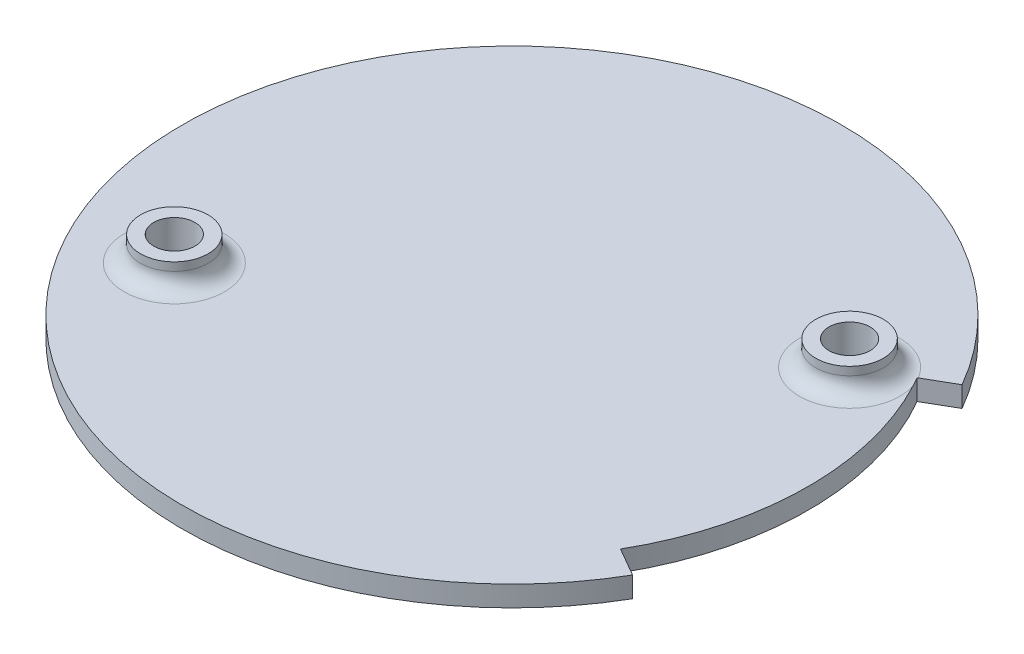
ISO-10303-21;
HEADER;
FILE_DESCRIPTION(('STEP AP214'),'2;1');
FILE_NAME('part.step','',(''),(''),'','','');
FILE_SCHEMA(('AUTOMOTIVE_DESIGN { 1 0 10303 214 1 1 1 1 }'));
ENDSEC;
DATA;
#1=APPLICATION_CONTEXT('core data for automotive mechanical design processes');
#2=APPLICATION_PROTOCOL_DEFINITION('international standard','automotive_design',2000,#1);
#3=PRODUCT_CONTEXT('',#1,'mechanical');
#4=PRODUCT('Part','Part','',(#3));
#5=PRODUCT_RELATED_PRODUCT_CATEGORY('part','',(#4));
#6=PRODUCT_DEFINITION_FORMATION('','',#4);
#7=PRODUCT_DEFINITION_CONTEXT('part definition',#1,'design');
#8=PRODUCT_DEFINITION('design','',#6,#7);
#9=PRODUCT_DEFINITION_SHAPE('','',#8);
#10=(LENGTH_UNIT() NAMED_UNIT(*) SI_UNIT(.MILLI.,.METRE.));
#11=(NAMED_UNIT(*) PLANE_ANGLE_UNIT() SI_UNIT($,.RADIAN.));
#12=(NAMED_UNIT(*) SI_UNIT($,.STERADIAN.) SOLID_ANGLE_UNIT());
#13=UNCERTAINTY_MEASURE_WITH_UNIT(LENGTH_MEASURE(1.E-05),#10,'distance_accuracy_value','');
#14=(GEOMETRIC_REPRESENTATION_CONTEXT(3) GLOBAL_UNCERTAINTY_ASSIGNED_CONTEXT((#13)) GLOBAL_UNIT_ASSIGNED_CONTEXT((#10,
#11,#12)) REPRESENTATION_CONTEXT('',''));
#15=CARTESIAN_POINT('',(0.,0.,0.));
#16=DIRECTION('',(0.,0.,1.));
#17=DIRECTION('',(1.,0.,0.));
#18=AXIS2_PLACEMENT_3D('',#15,#16,#17);
#19=CARTESIAN_POINT('',(0.,15.875,0.));
#20=DIRECTION('',(0.,1.,0.));
#21=DIRECTION('',(0.,0.,1.));
#22=AXIS2_PLACEMENT_3D('',#19,#20,#21);
#23=PLANE('',#22);
#24=CARTESIAN_POINT('',(-32.9955678841872,15.875,19.0499999999999));
#25=DIRECTION('',(0.,-1.,0.));
#26=DIRECTION('',(0.,0.,-1.));
#27=AXIS2_PLACEMENT_3D('',#24,#25,#26);
#28=CIRCLE('',#27,1.65);
#29=CARTESIAN_POINT('',(-32.9955678841872,15.875,17.3999999999999));
#30=VERTEX_POINT('',#29);
#31=EDGE_CURVE('E256',#30,#30,#28,.T.);
#32=ORIENTED_EDGE('',*,*,#31,.F.);
#33=EDGE_LOOP('',(#32));
#34=FACE_BOUND('',#33,.T.);
#35=CARTESIAN_POINT('',(32.9955678841872,15.875,-19.0499999999999));
#36=DIRECTION('',(0.,-1.,0.));
#37=DIRECTION('',(0.,0.,-1.));
#38=AXIS2_PLACEMENT_3D('',#35,#36,#37);
#39=CIRCLE('',#38,1.65);
#40=CARTESIAN_POINT('',(32.9955678841872,15.875,-20.6999999999999));
#41=VERTEX_POINT('',#40);
#42=EDGE_CURVE('E253',#41,#41,#39,.T.);
#43=ORIENTED_EDGE('',*,*,#42,.F.);
#44=EDGE_LOOP('',(#43));
#45=FACE_BOUND('',#44,.T.);
#46=DIRECTION('',(-0.866025403784438,0.,0.500000000000001));
#47=VECTOR('',#46,1.);
#48=CARTESIAN_POINT('',(0.,15.875,0.));
#49=LINE('',#48,#47);
#50=CARTESIAN_POINT('',(43.9940905122494,15.875,-25.4000000000001));
#51=VERTEX_POINT('',#50);
#52=CARTESIAN_POINT('',(39.5946814610245,15.875,-22.86));
#53=VERTEX_POINT('',#52);
#54=EDGE_CURVE('E91',#51,#53,#49,.T.);
#55=ORIENTED_EDGE('',*,*,#54,.T.);
#56=CARTESIAN_POINT('',(0.,15.875,0.));
#57=DIRECTION('',(0.,1.,0.));
#58=DIRECTION('',(0.,0.,1.));
#59=AXIS2_PLACEMENT_3D('',#56,#57,#58);
#60=CIRCLE('',#59,45.72);
#61=CARTESIAN_POINT('',(39.5946814610245,15.875,22.86));
#62=VERTEX_POINT('',#61);
#63=EDGE_CURVE('E92',#53,#62,#60,.F.);
#64=ORIENTED_EDGE('',*,*,#63,.T.);
#65=DIRECTION('',(-0.866025403784438,0.,-0.500000000000001));
#66=VECTOR('',#65,1.);
#67=CARTESIAN_POINT('',(0.,15.875,0.));
#68=LINE('',#67,#66);
#69=CARTESIAN_POINT('',(43.9940905122494,15.875,25.4000000000001));
#70=VERTEX_POINT('',#69);
#71=EDGE_CURVE('E105',#70,#62,#68,.T.);
#72=ORIENTED_EDGE('',*,*,#71,.F.);
#73=CARTESIAN_POINT('',(0.,15.875,0.));
#74=DIRECTION('',(0.,1.,0.));
#75=DIRECTION('',(0.,0.,1.));
#76=AXIS2_PLACEMENT_3D('',#73,#74,#75);
#77=CIRCLE('',#76,50.8);
#78=EDGE_CURVE('E95',#51,#70,#77,.T.);
#79=ORIENTED_EDGE('',*,*,#78,.F.);
#80=EDGE_LOOP('',(#55,#64,#72,#79));
#81=FACE_BOUND('',#80,.T.);
#82=ADVANCED_FACE('F40',(#34,#45,#81),#23,.F.);
#83=CARTESIAN_POINT('',(0.,3.175,0.));
#84=DIRECTION('',(0.,-1.,0.));
#85=DIRECTION('',(0.,0.,-1.));
#86=AXIS2_PLACEMENT_3D('',#83,#84,#85);
#87=CYLINDRICAL_SURFACE('',#86,50.8);
#88=DIRECTION('',(0.,1.,0.));
#89=VECTOR('',#88,1.);
#90=CARTESIAN_POINT('',(43.9940905122494,0.,-25.4000000000001));
#91=LINE('',#90,#89);
#92=CARTESIAN_POINT('',(43.9940905122494,19.05,-25.4000000000001));
#93=VERTEX_POINT('',#92);
#94=EDGE_CURVE('E109',#51,#93,#91,.T.);
#95=ORIENTED_EDGE('',*,*,#94,.F.);
#96=ORIENTED_EDGE('',*,*,#78,.T.);
#97=DIRECTION('',(0.,1.,0.));
#98=VECTOR('',#97,1.);
#99=CARTESIAN_POINT('',(43.9940905122494,0.,25.4000000000001));
#100=LINE('',#99,#98);
#101=CARTESIAN_POINT('',(43.9940905122494,19.05,25.4000000000001));
#102=VERTEX_POINT('',#101);
#103=EDGE_CURVE('E113',#70,#102,#100,.T.);
#104=ORIENTED_EDGE('',*,*,#103,.T.);
#105=CARTESIAN_POINT('',(0.,19.05,0.));
#106=DIRECTION('',(0.,1.,0.));
#107=DIRECTION('',(0.,0.,1.));
#108=AXIS2_PLACEMENT_3D('',#105,#106,#107);
#109=CIRCLE('',#108,50.8);
#110=EDGE_CURVE('E177',#93,#102,#109,.T.);
#111=ORIENTED_EDGE('',*,*,#110,.F.);
#112=EDGE_LOOP('',(#95,#96,#104,#111));
#113=FACE_BOUND('',#112,.T.);
#114=ADVANCED_FACE('F147',(#113),#87,.T.);
#115=CARTESIAN_POINT('',(0.,0.,0.));
#116=DIRECTION('',(-0.500000000000001,0.,0.866025403784438));
#117=DIRECTION('',(0.866025403784438,0.,0.500000000000001));
#118=AXIS2_PLACEMENT_3D('',#115,#116,#117);
#119=PLANE('',#118);
#120=ORIENTED_EDGE('',*,*,#103,.F.);
#121=ORIENTED_EDGE('',*,*,#71,.T.);
#122=DIRECTION('',(0.,1.,0.));
#123=VECTOR('',#122,1.);
#124=CARTESIAN_POINT('',(39.5946814610245,0.,22.86));
#125=LINE('',#124,#123);
#126=CARTESIAN_POINT('',(39.5946814610245,19.05,22.86));
#127=VERTEX_POINT('',#126);
#128=EDGE_CURVE('E104',#62,#127,#125,.T.);
#129=ORIENTED_EDGE('',*,*,#128,.T.);
#130=DIRECTION('',(-0.866025403784438,0.,-0.500000000000001));
#131=VECTOR('',#130,1.);
#132=CARTESIAN_POINT('',(0.,19.05,0.));
#133=LINE('',#132,#131);
#134=EDGE_CURVE('E174',#102,#127,#133,.T.);
#135=ORIENTED_EDGE('',*,*,#134,.F.);
#136=EDGE_LOOP('',(#120,#121,#129,#135));
#137=FACE_BOUND('',#136,.T.);
#138=ADVANCED_FACE('F153',(#137),#119,.F.);
#139=CARTESIAN_POINT('',(0.,0.,0.));
#140=DIRECTION('',(0.,1.,0.));
#141=DIRECTION('',(0.,0.,1.));
#142=AXIS2_PLACEMENT_3D('',#139,#140,#141);
#143=CYLINDRICAL_SURFACE('',#142,45.72);
#144=ORIENTED_EDGE('',*,*,#63,.F.);
#145=DIRECTION('',(0.,1.,0.));
#146=VECTOR('',#145,1.);
#147=CARTESIAN_POINT('',(39.5946814610245,0.,-22.8600000000001));
#148=LINE('',#147,#146);
#149=CARTESIAN_POINT('',(39.5946814610245,19.0531769868593,-22.8600000000001));
#150=VERTEX_POINT('',#149);
#151=EDGE_CURVE('E59',#53,#150,#148,.T.);
#152=ORIENTED_EDGE('',*,*,#151,.T.);
#153=CARTESIAN_POINT('',(39.5946814610245,19.0531769868593,-22.8600000000001));
#154=CARTESIAN_POINT('',(39.6584509865653,19.0531940198967,-22.7495479663954));
#155=CARTESIAN_POINT('',(39.7217581950967,19.0530434085188,-22.6388293044365));
#156=CARTESIAN_POINT('',(39.8474392470708,19.0525347988836,-22.4168742014402));
#157=CARTESIAN_POINT('',(39.9098131557882,19.0521768152002,-22.3056377973336));
#158=CARTESIAN_POINT('',(40.0336277838406,19.0513813297176,-22.0826472645168));
#159=CARTESIAN_POINT('',(40.0950685040283,19.0509438279912,-21.9708931362797));
#160=CARTESIAN_POINT('',(40.2170171736378,19.0502604060662,-21.746866345461));
#161=CARTESIAN_POINT('',(40.277525056747,19.0500144994265,-21.6345936467463));
#162=CARTESIAN_POINT('',(40.3375623533858,19.05,-21.5220692171247));
#163=B_SPLINE_CURVE_WITH_KNOTS('',3,(#153,#154,#155,#156,#157,#158,#159,#160,#161,#162),
.UNSPECIFIED.,.F.,.F.,(4,2,2,2,4),(0.,0.382615476870098,0.765204067465549,1.14779230850627,
1.53040762235897),.UNSPECIFIED.);
#164=CARTESIAN_POINT('',(40.3375623533858,19.05,-21.5220692171247));
#165=VERTEX_POINT('',#164);
#166=EDGE_CURVE('E11',#150,#165,#163,.T.);
#167=ORIENTED_EDGE('',*,*,#166,.T.);
#168=CARTESIAN_POINT('',(0.,19.05,0.));
#169=DIRECTION('',(0.,1.,0.));
#170=DIRECTION('',(0.,0.,1.));
#171=AXIS2_PLACEMENT_3D('',#168,#169,#170);
#172=CIRCLE('',#171,45.72);
#173=EDGE_CURVE('E183',#127,#165,#172,.T.);
#174=ORIENTED_EDGE('',*,*,#173,.F.);
#175=ORIENTED_EDGE('',*,*,#128,.F.);
#176=EDGE_LOOP('',(#144,#152,#167,#174,#175));
#177=FACE_BOUND('',#176,.T.);
#178=ADVANCED_FACE('F102',(#177),#143,.T.);
#179=CARTESIAN_POINT('',(0.,0.,0.));
#180=DIRECTION('',(0.500000000000001,0.,0.866025403784438));
#181=DIRECTION('',(0.866025403784438,0.,-0.500000000000001));
#182=AXIS2_PLACEMENT_3D('',#179,#180,#181);
#183=PLANE('',#182);
#184=ORIENTED_EDGE('',*,*,#54,.F.);
#185=ORIENTED_EDGE('',*,*,#94,.T.);
#186=DIRECTION('',(0.866025403784438,0.,-0.500000000000001));
#187=VECTOR('',#186,1.);
#188=CARTESIAN_POINT('',(0.,19.05,0.));
#189=LINE('',#188,#187);
#190=CARTESIAN_POINT('',(39.7046666873051,19.05,-22.9235000000001));
#191=VERTEX_POINT('',#190);
#192=EDGE_CURVE('E118',#191,#93,#189,.T.);
#193=ORIENTED_EDGE('',*,*,#192,.F.);
#194=CARTESIAN_POINT('',(39.7046666873052,21.59,-22.9234999999999));
#195=DIRECTION('',(0.500000000000001,0.,0.866025403784438));
#196=DIRECTION('',(0.866025403784438,0.,-0.500000000000001));
#197=AXIS2_PLACEMENT_3D('',#194,#195,#196);
#198=CIRCLE('',#197,2.54);
#199=EDGE_CURVE('E53',#191,#150,#198,.F.);
#200=ORIENTED_EDGE('',*,*,#199,.T.);
#201=ORIENTED_EDGE('',*,*,#151,.F.);
#202=EDGE_LOOP('',(#184,#185,#193,#200,#201));
#203=FACE_BOUND('',#202,.T.);
#204=ADVANCED_FACE('F107',(#203),#183,.T.);
#205=CARTESIAN_POINT('',(0.,19.05,0.));
#206=DIRECTION('',(0.,1.,0.));
#207=DIRECTION('',(0.,0.,1.));
#208=AXIS2_PLACEMENT_3D('',#205,#206,#207);
#209=PLANE('',#208);
#210=CARTESIAN_POINT('',(-32.9955678841872,19.05,19.0499999999999));
#211=DIRECTION('',(0.,1.,0.));
#212=DIRECTION('',(0.,0.,1.));
#213=AXIS2_PLACEMENT_3D('',#210,#211,#212);
#214=CIRCLE('',#213,7.747);
#215=CARTESIAN_POINT('',(-32.9955678841872,19.05,26.7969999999999));
#216=VERTEX_POINT('',#215);
#217=EDGE_CURVE('E121',#216,#216,#214,.F.);
#218=ORIENTED_EDGE('',*,*,#217,.T.);
#219=EDGE_LOOP('',(#218));
#220=FACE_BOUND('',#219,.T.);
#221=ORIENTED_EDGE('',*,*,#173,.T.);
#222=CARTESIAN_POINT('',(32.9955678841872,19.05,-19.0499999999999));
#223=DIRECTION('',(0.,1.,0.));
#224=DIRECTION('',(0.,0.,1.));
#225=AXIS2_PLACEMENT_3D('',#222,#223,#224);
#226=CIRCLE('',#225,7.747);
#227=EDGE_CURVE('E124',#165,#191,#226,.F.);
#228=ORIENTED_EDGE('',*,*,#227,.T.);
#229=ORIENTED_EDGE('',*,*,#192,.T.);
#230=ORIENTED_EDGE('',*,*,#110,.T.);
#231=ORIENTED_EDGE('',*,*,#134,.T.);
#232=EDGE_LOOP('',(#221,#228,#229,#230,#231));
#233=FACE_BOUND('',#232,.T.);
#234=ADVANCED_FACE('F159',(#220,#233),#209,.T.);
#235=CARTESIAN_POINT('',(32.9955678841872,17.78,-19.0499999999999));
#236=DIRECTION('',(0.,1.,0.));
#237=DIRECTION('',(0.,0.,1.));
#238=AXIS2_PLACEMENT_3D('',#235,#236,#237);
#239=PLANE('',#238);
#240=CARTESIAN_POINT('',(32.9955678841872,17.78,-19.0499999999999));
#241=DIRECTION('',(0.,1.,0.));
#242=DIRECTION('',(0.,0.,1.));
#243=AXIS2_PLACEMENT_3D('',#240,#241,#242);
#244=CIRCLE('',#243,1.65);
#245=CARTESIAN_POINT('',(32.9955678841872,17.78,-17.3999999999999));
#246=VERTEX_POINT('',#245);
#247=EDGE_CURVE('E251',#246,#246,#244,.F.);
#248=ORIENTED_EDGE('',*,*,#247,.T.);
#249=EDGE_LOOP('',(#248));
#250=FACE_BOUND('',#249,.T.);
#251=CARTESIAN_POINT('',(32.9955678841872,17.78,-19.0499999999999));
#252=DIRECTION('',(0.,1.,0.));
#253=DIRECTION('',(0.,0.,1.));
#254=AXIS2_PLACEMENT_3D('',#251,#252,#253);
#255=CIRCLE('',#254,3.175);
#256=CARTESIAN_POINT('',(32.9955678841872,17.78,-15.8749999999999));
#257=VERTEX_POINT('',#256);
#258=EDGE_CURVE('E211',#257,#257,#255,.T.);
#259=ORIENTED_EDGE('',*,*,#258,.T.);
#260=EDGE_LOOP('',(#259));
#261=FACE_BOUND('',#260,.T.);
#262=ADVANCED_FACE('F217',(#250,#261),#239,.T.);
#263=CARTESIAN_POINT('',(32.9955678841872,17.78,-19.0499999999999));
#264=DIRECTION('',(0.,1.,0.));
#265=DIRECTION('',(0.,0.,1.));
#266=AXIS2_PLACEMENT_3D('',#263,#264,#265);
#267=CYLINDRICAL_SURFACE('',#266,3.175);
#268=ORIENTED_EDGE('',*,*,#258,.F.);
#269=EDGE_LOOP('',(#268));
#270=FACE_BOUND('',#269,.T.);
#271=CARTESIAN_POINT('',(32.9955678841872,22.86,-19.0499999999999));
#272=DIRECTION('',(0.,1.,0.));
#273=DIRECTION('',(0.,0.,1.));
#274=AXIS2_PLACEMENT_3D('',#271,#272,#273);
#275=CIRCLE('',#274,3.175);
#276=CARTESIAN_POINT('',(32.9955678841872,22.86,-15.8749999999999));
#277=VERTEX_POINT('',#276);
#278=EDGE_CURVE('E199',#277,#277,#275,.F.);
#279=ORIENTED_EDGE('',*,*,#278,.F.);
#280=EDGE_LOOP('',(#279));
#281=FACE_BOUND('',#280,.T.);
#282=ADVANCED_FACE('F219',(#270,#281),#267,.F.);
#283=CARTESIAN_POINT('',(-32.9955678841872,17.78,19.0499999999999));
#284=DIRECTION('',(0.,1.,0.));
#285=DIRECTION('',(0.,0.,1.));
#286=AXIS2_PLACEMENT_3D('',#283,#284,#285);
#287=PLANE('',#286);
#288=CARTESIAN_POINT('',(-32.9955678841872,17.78,19.0499999999999));
#289=DIRECTION('',(0.,1.,0.));
#290=DIRECTION('',(0.,0.,1.));
#291=AXIS2_PLACEMENT_3D('',#288,#289,#290);
#292=CIRCLE('',#291,1.65);
#293=CARTESIAN_POINT('',(-32.9955678841872,17.78,20.6999999999999));
#294=VERTEX_POINT('',#293);
#295=EDGE_CURVE('E205',#294,#294,#292,.F.);
#296=ORIENTED_EDGE('',*,*,#295,.T.);
#297=EDGE_LOOP('',(#296));
#298=FACE_BOUND('',#297,.T.);
#299=CARTESIAN_POINT('',(-32.9955678841872,17.78,19.0499999999999));
#300=DIRECTION('',(0.,1.,0.));
#301=DIRECTION('',(0.,0.,1.));
#302=AXIS2_PLACEMENT_3D('',#299,#300,#301);
#303=CIRCLE('',#302,3.175);
#304=CARTESIAN_POINT('',(-32.9955678841872,17.78,22.2249999999999));
#305=VERTEX_POINT('',#304);
#306=EDGE_CURVE('E99',#305,#305,#303,.T.);
#307=ORIENTED_EDGE('',*,*,#306,.T.);
#308=EDGE_LOOP('',(#307));
#309=FACE_BOUND('',#308,.T.);
#310=ADVANCED_FACE('F222',(#298,#309),#287,.T.);
#311=CARTESIAN_POINT('',(-32.9955678841872,17.78,19.0499999999999));
#312=DIRECTION('',(0.,1.,0.));
#313=DIRECTION('',(0.,0.,1.));
#314=AXIS2_PLACEMENT_3D('',#311,#312,#313);
#315=CYLINDRICAL_SURFACE('',#314,3.175);
#316=ORIENTED_EDGE('',*,*,#306,.F.);
#317=EDGE_LOOP('',(#316));
#318=FACE_BOUND('',#317,.T.);
#319=CARTESIAN_POINT('',(-32.9955678841872,22.86,19.0499999999999));
#320=DIRECTION('',(0.,1.,0.));
#321=DIRECTION('',(0.,0.,1.));
#322=AXIS2_PLACEMENT_3D('',#319,#320,#321);
#323=CIRCLE('',#322,3.175);
#324=CARTESIAN_POINT('',(-32.9955678841872,22.86,22.2249999999999));
#325=VERTEX_POINT('',#324);
#326=EDGE_CURVE('E198',#325,#325,#323,.F.);
#327=ORIENTED_EDGE('',*,*,#326,.F.);
#328=EDGE_LOOP('',(#327));
#329=FACE_BOUND('',#328,.T.);
#330=ADVANCED_FACE('F237',(#318,#329),#315,.F.);
#331=CARTESIAN_POINT('',(-32.9955678841872,22.86,19.0499999999999));
#332=DIRECTION('',(0.,-1.,0.));
#333=DIRECTION('',(0.,0.,-1.));
#334=AXIS2_PLACEMENT_3D('',#331,#332,#333);
#335=CYLINDRICAL_SURFACE('',#334,5.207);
#336=CARTESIAN_POINT('',(-32.9955678841872,21.59,19.0499999999999));
#337=DIRECTION('',(0.,1.,0.));
#338=DIRECTION('',(0.,0.,1.));
#339=AXIS2_PLACEMENT_3D('',#336,#337,#338);
#340=CIRCLE('',#339,5.207);
#341=CARTESIAN_POINT('',(-32.9955678841872,21.59,13.8429999999999));
#342=VERTEX_POINT('',#341);
#343=EDGE_CURVE('E126',#342,#342,#340,.T.);
#344=CARTESIAN_POINT('',(-32.9955678841872,22.86,19.0499999999999));
#345=DIRECTION('',(0.,1.,0.));
#346=DIRECTION('',(0.,0.,1.));
#347=AXIS2_PLACEMENT_3D('',#344,#345,#346);
#348=CIRCLE('',#347,5.207);
#349=CARTESIAN_POINT('',(-32.9955678841872,22.86,13.8429999999999));
#350=VERTEX_POINT('',#349);
#351=EDGE_CURVE('E202',#350,#350,#348,.T.);
#352=CARTESIAN_POINT('',(-32.9955678841872,21.59,13.8429999999999));
#353=CARTESIAN_POINT('',(-32.9955678841872,21.6032291666667,13.8429999999999));
#354=CARTESIAN_POINT('',(-32.9955678841872,21.6164583333333,13.8429999999999));
#355=CARTESIAN_POINT('',(-32.9955678841872,21.6429166666667,13.8429999999999));
#356=CARTESIAN_POINT('',(-32.9955678841872,21.6561458333333,13.8429999999999));
#357=CARTESIAN_POINT('',(-32.9955678841872,21.6826041666667,13.8429999999999));
#358=CARTESIAN_POINT('',(-32.9955678841872,21.6958333333333,13.8429999999999));
#359=CARTESIAN_POINT('',(-32.9955678841872,21.7222916666667,13.8429999999999));
#360=CARTESIAN_POINT('',(-32.9955678841872,21.7355208333333,13.8429999999999));
#361=CARTESIAN_POINT('',(-32.9955678841872,21.7619791666667,13.8429999999999));
#362=CARTESIAN_POINT('',(-32.9955678841872,21.7752083333333,13.8429999999999));
#363=CARTESIAN_POINT('',(-32.9955678841872,21.8016666666667,13.8429999999999));
#364=CARTESIAN_POINT('',(-32.9955678841872,21.8148958333333,13.8429999999999));
#365=CARTESIAN_POINT('',(-32.9955678841872,21.8413541666667,13.8429999999999));
#366=CARTESIAN_POINT('',(-32.9955678841872,21.8545833333333,13.8429999999999));
#367=CARTESIAN_POINT('',(-32.9955678841872,21.8810416666667,13.8429999999999));
#368=CARTESIAN_POINT('',(-32.9955678841872,21.8942708333333,13.8429999999999));
#369=CARTESIAN_POINT('',(-32.9955678841872,21.9207291666667,13.8429999999999));
#370=CARTESIAN_POINT('',(-32.9955678841872,21.9339583333333,13.8429999999999));
#371=CARTESIAN_POINT('',(-32.9955678841872,21.9604166666667,13.8429999999999));
#372=CARTESIAN_POINT('',(-32.9955678841872,21.9736458333333,13.8429999999999));
#373=CARTESIAN_POINT('',(-32.9955678841872,22.0001041666667,13.8429999999999));
#374=CARTESIAN_POINT('',(-32.9955678841872,22.0133333333333,13.8429999999999));
#375=CARTESIAN_POINT('',(-32.9955678841872,22.0397916666667,13.8429999999999));
#376=CARTESIAN_POINT('',(-32.9955678841872,22.0530208333333,13.8429999999999));
#377=CARTESIAN_POINT('',(-32.9955678841872,22.0794791666667,13.8429999999999));
#378=CARTESIAN_POINT('',(-32.9955678841872,22.0927083333333,13.8429999999999));
#379=CARTESIAN_POINT('',(-32.9955678841872,22.1191666666667,13.8429999999999));
#380=CARTESIAN_POINT('',(-32.9955678841872,22.1323958333333,13.8429999999999));
#381=CARTESIAN_POINT('',(-32.9955678841872,22.1588541666667,13.8429999999999));
#382=CARTESIAN_POINT('',(-32.9955678841872,22.1720833333333,13.8429999999999));
#383=CARTESIAN_POINT('',(-32.9955678841872,22.1985416666667,13.8429999999999));
#384=CARTESIAN_POINT('',(-32.9955678841872,22.2117708333333,13.8429999999999));
#385=CARTESIAN_POINT('',(-32.9955678841872,22.2382291666667,13.8429999999999));
#386=CARTESIAN_POINT('',(-32.9955678841872,22.2514583333333,13.8429999999999));
#387=CARTESIAN_POINT('',(-32.9955678841872,22.2779166666667,13.8429999999999));
#388=CARTESIAN_POINT('',(-32.9955678841872,22.2911458333333,13.8429999999999));
#389=CARTESIAN_POINT('',(-32.9955678841872,22.3176041666667,13.8429999999999));
#390=CARTESIAN_POINT('',(-32.9955678841872,22.3308333333333,13.8429999999999));
#391=CARTESIAN_POINT('',(-32.9955678841872,22.3572916666667,13.8429999999999));
#392=CARTESIAN_POINT('',(-32.9955678841872,22.3705208333333,13.8429999999999));
#393=CARTESIAN_POINT('',(-32.9955678841872,22.3969791666667,13.8429999999999));
#394=CARTESIAN_POINT('',(-32.9955678841872,22.4102083333333,13.8429999999999));
#395=CARTESIAN_POINT('',(-32.9955678841872,22.4366666666667,13.8429999999999));
#396=CARTESIAN_POINT('',(-32.9955678841872,22.4498958333333,13.8429999999999));
#397=CARTESIAN_POINT('',(-32.9955678841872,22.4763541666667,13.8429999999999));
#398=CARTESIAN_POINT('',(-32.9955678841872,22.4895833333333,13.8429999999999));
#399=CARTESIAN_POINT('',(-32.9955678841872,22.5160416666667,13.8429999999999));
#400=CARTESIAN_POINT('',(-32.9955678841872,22.5292708333333,13.8429999999999));
#401=CARTESIAN_POINT('',(-32.9955678841872,22.5557291666667,13.8429999999999));
#402=CARTESIAN_POINT('',(-32.9955678841872,22.5689583333333,13.8429999999999));
#403=CARTESIAN_POINT('',(-32.9955678841872,22.5954166666667,13.8429999999999));
#404=CARTESIAN_POINT('',(-32.9955678841872,22.6086458333333,13.8429999999999));
#405=CARTESIAN_POINT('',(-32.9955678841872,22.6351041666667,13.8429999999999));
#406=CARTESIAN_POINT('',(-32.9955678841872,22.6483333333333,13.8429999999999));
#407=CARTESIAN_POINT('',(-32.9955678841872,22.6747916666667,13.8429999999999));
#408=CARTESIAN_POINT('',(-32.9955678841872,22.6880208333333,13.8429999999999));
#409=CARTESIAN_POINT('',(-32.9955678841872,22.7144791666667,13.8429999999999));
#410=CARTESIAN_POINT('',(-32.9955678841872,22.7277083333333,13.8429999999999));
#411=CARTESIAN_POINT('',(-32.9955678841872,22.7541666666667,13.8429999999999));
#412=CARTESIAN_POINT('',(-32.9955678841872,22.7673958333333,13.8429999999999));
#413=CARTESIAN_POINT('',(-32.9955678841872,22.7938541666667,13.8429999999999));
#414=CARTESIAN_POINT('',(-32.9955678841872,22.8070833333333,13.8429999999999));
#415=CARTESIAN_POINT('',(-32.9955678841872,22.8335416666667,13.8429999999999));
#416=CARTESIAN_POINT('',(-32.9955678841872,22.8467708333333,13.8429999999999));
#417=CARTESIAN_POINT('',(-32.9955678841872,22.86,13.8429999999999));
#418=B_SPLINE_CURVE_WITH_KNOTS('',3,(#352,#353,#354,#355,#356,#357,#358,#359,#360,#361,#362,
#363,#364,#365,#366,#367,#368,#369,#370,#371,#372,#373,#374,#375,#376,#377,#378,#379,#380,#381,
#382,#383,#384,#385,#386,#387,#388,#389,#390,#391,#392,#393,#394,#395,#396,#397,#398,#399,#400,
#401,#402,#403,#404,#405,#406,#407,#408,#409,#410,#411,#412,#413,#414,#415,#416,#417),
.UNSPECIFIED.,.F.,.F.,(4,2,2,2,2,2,2,2,2,2,2,2,2,2,2,2,2,2,2,2,2,2,2,2,2,2,2,2,2,2,2,2,4),(0.,
0.0396874999999998,0.0793749999999996,0.119062499999999,0.158749999999999,0.198437499999999,
0.238124999999999,0.277812499999999,0.317499999999998,0.357187499999998,0.396874999999998,
0.436562499999998,0.476249999999998,0.515937499999997,0.555624999999997,0.595312499999997,0.635,
0.6746875,0.714375,0.7540625,0.793749999999999,0.833437499999999,0.873124999999999,
0.912812499999999,0.952499999999998,0.992187499999998,1.031875,1.0715625,1.11125,1.1509375,
1.190625,1.2303125,1.27),.UNSPECIFIED.);
#419=EDGE_CURVE('BSEAM130',#342,#350,#418,.T.);
#420=ORIENTED_EDGE('',*,*,#343,.T.);
#421=ORIENTED_EDGE('',*,*,#351,.F.);
#422=ORIENTED_EDGE('',*,*,#419,.T.);
#423=ORIENTED_EDGE('',*,*,#419,.F.);
#424=EDGE_LOOP('',(#420,#422,#421,#423));
#425=FACE_BOUND('',#424,.T.);
#426=ADVANCED_FACE('F130',(#425),#335,.T.);
#427=CARTESIAN_POINT('',(0.,22.86,0.));
#428=DIRECTION('',(0.,1.,0.));
#429=DIRECTION('',(0.,0.,1.));
#430=AXIS2_PLACEMENT_3D('',#427,#428,#429);
#431=PLANE('',#430);
#432=ORIENTED_EDGE('',*,*,#326,.T.);
#433=EDGE_LOOP('',(#432));
#434=FACE_BOUND('',#433,.T.);
#435=ORIENTED_EDGE('',*,*,#351,.T.);
#436=EDGE_LOOP('',(#435));
#437=FACE_BOUND('',#436,.T.);
#438=ADVANCED_FACE('F192',(#434,#437),#431,.T.);
#439=CARTESIAN_POINT('',(32.9955678841872,22.86,-19.0499999999999));
#440=DIRECTION('',(0.,-1.,0.));
#441=DIRECTION('',(0.,0.,-1.));
#442=AXIS2_PLACEMENT_3D('',#439,#440,#441);
#443=CYLINDRICAL_SURFACE('',#442,5.207);
#444=CARTESIAN_POINT('',(32.9955678841872,21.59,-19.0499999999999));
#445=DIRECTION('',(0.,1.,0.));
#446=DIRECTION('',(0.,0.,1.));
#447=AXIS2_PLACEMENT_3D('',#444,#445,#446);
#448=CIRCLE('',#447,5.207);
#449=CARTESIAN_POINT('',(32.9955678841872,21.59,-24.2569999999999));
#450=VERTEX_POINT('',#449);
#451=EDGE_CURVE('E111',#450,#450,#448,.T.);
#452=CARTESIAN_POINT('',(32.9955678841872,22.86,-19.0499999999999));
#453=DIRECTION('',(0.,1.,0.));
#454=DIRECTION('',(0.,0.,1.));
#455=AXIS2_PLACEMENT_3D('',#452,#453,#454);
#456=CIRCLE('',#455,5.207);
#457=CARTESIAN_POINT('',(32.9955678841872,22.86,-24.2569999999999));
#458=VERTEX_POINT('',#457);
#459=EDGE_CURVE('E196',#458,#458,#456,.T.);
#460=CARTESIAN_POINT('',(32.9955678841872,21.59,-24.2569999999999));
#461=CARTESIAN_POINT('',(32.9955678841872,21.6032291666667,-24.2569999999999));
#462=CARTESIAN_POINT('',(32.9955678841872,21.6164583333333,-24.2569999999999));
#463=CARTESIAN_POINT('',(32.9955678841872,21.6429166666667,-24.2569999999999));
#464=CARTESIAN_POINT('',(32.9955678841872,21.6561458333333,-24.2569999999999));
#465=CARTESIAN_POINT('',(32.9955678841872,21.6826041666667,-24.2569999999999));
#466=CARTESIAN_POINT('',(32.9955678841872,21.6958333333333,-24.2569999999999));
#467=CARTESIAN_POINT('',(32.9955678841872,21.7222916666667,-24.2569999999999));
#468=CARTESIAN_POINT('',(32.9955678841872,21.7355208333333,-24.2569999999999));
#469=CARTESIAN_POINT('',(32.9955678841872,21.7619791666667,-24.2569999999999));
#470=CARTESIAN_POINT('',(32.9955678841872,21.7752083333333,-24.2569999999999));
#471=CARTESIAN_POINT('',(32.9955678841872,21.8016666666667,-24.2569999999999));
#472=CARTESIAN_POINT('',(32.9955678841872,21.8148958333333,-24.2569999999999));
#473=CARTESIAN_POINT('',(32.9955678841872,21.8413541666667,-24.2569999999999));
#474=CARTESIAN_POINT('',(32.9955678841872,21.8545833333333,-24.2569999999999));
#475=CARTESIAN_POINT('',(32.9955678841872,21.8810416666667,-24.2569999999999));
#476=CARTESIAN_POINT('',(32.9955678841872,21.8942708333333,-24.2569999999999));
#477=CARTESIAN_POINT('',(32.9955678841872,21.9207291666667,-24.2569999999999));
#478=CARTESIAN_POINT('',(32.9955678841872,21.9339583333333,-24.2569999999999));
#479=CARTESIAN_POINT('',(32.9955678841872,21.9604166666667,-24.2569999999999));
#480=CARTESIAN_POINT('',(32.9955678841872,21.9736458333333,-24.2569999999999));
#481=CARTESIAN_POINT('',(32.9955678841872,22.0001041666667,-24.2569999999999));
#482=CARTESIAN_POINT('',(32.9955678841872,22.0133333333333,-24.2569999999999));
#483=CARTESIAN_POINT('',(32.9955678841872,22.0397916666667,-24.2569999999999));
#484=CARTESIAN_POINT('',(32.9955678841872,22.0530208333333,-24.2569999999999));
#485=CARTESIAN_POINT('',(32.9955678841872,22.0794791666667,-24.2569999999999));
#486=CARTESIAN_POINT('',(32.9955678841872,22.0927083333333,-24.2569999999999));
#487=CARTESIAN_POINT('',(32.9955678841872,22.1191666666667,-24.2569999999999));
#488=CARTESIAN_POINT('',(32.9955678841872,22.1323958333333,-24.2569999999999));
#489=CARTESIAN_POINT('',(32.9955678841872,22.1588541666667,-24.2569999999999));
#490=CARTESIAN_POINT('',(32.9955678841872,22.1720833333333,-24.2569999999999));
#491=CARTESIAN_POINT('',(32.9955678841872,22.1985416666667,-24.2569999999999));
#492=CARTESIAN_POINT('',(32.9955678841872,22.2117708333333,-24.2569999999999));
#493=CARTESIAN_POINT('',(32.9955678841872,22.2382291666667,-24.2569999999999));
#494=CARTESIAN_POINT('',(32.9955678841872,22.2514583333333,-24.2569999999999));
#495=CARTESIAN_POINT('',(32.9955678841872,22.2779166666667,-24.2569999999999));
#496=CARTESIAN_POINT('',(32.9955678841872,22.2911458333333,-24.2569999999999));
#497=CARTESIAN_POINT('',(32.9955678841872,22.3176041666667,-24.2569999999999));
#498=CARTESIAN_POINT('',(32.9955678841872,22.3308333333333,-24.2569999999999));
#499=CARTESIAN_POINT('',(32.9955678841872,22.3572916666667,-24.2569999999999));
#500=CARTESIAN_POINT('',(32.9955678841872,22.3705208333333,-24.2569999999999));
#501=CARTESIAN_POINT('',(32.9955678841872,22.3969791666667,-24.2569999999999));
#502=CARTESIAN_POINT('',(32.9955678841872,22.4102083333333,-24.2569999999999));
#503=CARTESIAN_POINT('',(32.9955678841872,22.4366666666667,-24.2569999999999));
#504=CARTESIAN_POINT('',(32.9955678841872,22.4498958333333,-24.2569999999999));
#505=CARTESIAN_POINT('',(32.9955678841872,22.4763541666667,-24.2569999999999));
#506=CARTESIAN_POINT('',(32.9955678841872,22.4895833333333,-24.2569999999999));
#507=CARTESIAN_POINT('',(32.9955678841872,22.5160416666667,-24.2569999999999));
#508=CARTESIAN_POINT('',(32.9955678841872,22.5292708333333,-24.2569999999999));
#509=CARTESIAN_POINT('',(32.9955678841872,22.5557291666667,-24.2569999999999));
#510=CARTESIAN_POINT('',(32.9955678841872,22.5689583333333,-24.2569999999999));
#511=CARTESIAN_POINT('',(32.9955678841872,22.5954166666667,-24.2569999999999));
#512=CARTESIAN_POINT('',(32.9955678841872,22.6086458333333,-24.2569999999999));
#513=CARTESIAN_POINT('',(32.9955678841872,22.6351041666667,-24.2569999999999));
#514=CARTESIAN_POINT('',(32.9955678841872,22.6483333333333,-24.2569999999999));
#515=CARTESIAN_POINT('',(32.9955678841872,22.6747916666667,-24.2569999999999));
#516=CARTESIAN_POINT('',(32.9955678841872,22.6880208333333,-24.2569999999999));
#517=CARTESIAN_POINT('',(32.9955678841872,22.7144791666667,-24.2569999999999));
#518=CARTESIAN_POINT('',(32.9955678841872,22.7277083333333,-24.2569999999999));
#519=CARTESIAN_POINT('',(32.9955678841872,22.7541666666667,-24.2569999999999));
#520=CARTESIAN_POINT('',(32.9955678841872,22.7673958333333,-24.2569999999999));
#521=CARTESIAN_POINT('',(32.9955678841872,22.7938541666667,-24.2569999999999));
#522=CARTESIAN_POINT('',(32.9955678841872,22.8070833333333,-24.2569999999999));
#523=CARTESIAN_POINT('',(32.9955678841872,22.8335416666667,-24.2569999999999));
#524=CARTESIAN_POINT('',(32.9955678841872,22.8467708333333,-24.2569999999999));
#525=CARTESIAN_POINT('',(32.9955678841872,22.86,-24.2569999999999));
#526=B_SPLINE_CURVE_WITH_KNOTS('',3,(#460,#461,#462,#463,#464,#465,#466,#467,#468,#469,#470,
#471,#472,#473,#474,#475,#476,#477,#478,#479,#480,#481,#482,#483,#484,#485,#486,#487,#488,#489,
#490,#491,#492,#493,#494,#495,#496,#497,#498,#499,#500,#501,#502,#503,#504,#505,#506,#507,#508,
#509,#510,#511,#512,#513,#514,#515,#516,#517,#518,#519,#520,#521,#522,#523,#524,#525),
.UNSPECIFIED.,.F.,.F.,(4,2,2,2,2,2,2,2,2,2,2,2,2,2,2,2,2,2,2,2,2,2,2,2,2,2,2,2,2,2,2,2,4),(0.,
0.0396874999999998,0.0793749999999996,0.119062499999999,0.158749999999999,0.198437499999999,
0.238124999999999,0.277812499999999,0.317499999999998,0.357187499999998,0.396874999999998,
0.436562499999998,0.476249999999998,0.515937499999997,0.555624999999997,0.595312499999997,0.635,
0.6746875,0.714375,0.7540625,0.793749999999999,0.833437499999999,0.873124999999999,
0.912812499999999,0.952499999999998,0.992187499999998,1.031875,1.0715625,1.11125,1.1509375,
1.190625,1.2303125,1.27),.UNSPECIFIED.);
#527=EDGE_CURVE('BSEAM189',#450,#458,#526,.T.);
#528=ORIENTED_EDGE('',*,*,#451,.T.);
#529=ORIENTED_EDGE('',*,*,#459,.F.);
#530=ORIENTED_EDGE('',*,*,#527,.T.);
#531=ORIENTED_EDGE('',*,*,#527,.F.);
#532=EDGE_LOOP('',(#528,#530,#529,#531));
#533=FACE_BOUND('',#532,.T.);
#534=ADVANCED_FACE('F189',(#533),#443,.T.);
#535=CARTESIAN_POINT('',(0.,22.86,0.));
#536=DIRECTION('',(0.,1.,0.));
#537=DIRECTION('',(0.,0.,1.));
#538=AXIS2_PLACEMENT_3D('',#535,#536,#537);
#539=PLANE('',#538);
#540=ORIENTED_EDGE('',*,*,#278,.T.);
#541=EDGE_LOOP('',(#540));
#542=FACE_BOUND('',#541,.T.);
#543=ORIENTED_EDGE('',*,*,#459,.T.);
#544=EDGE_LOOP('',(#543));
#545=FACE_BOUND('',#544,.T.);
#546=ADVANCED_FACE('F144',(#542,#545),#539,.T.);
#547=CARTESIAN_POINT('',(32.9955678841872,21.59,-19.0499999999999));
#548=DIRECTION('',(0.,1.,0.));
#549=DIRECTION('',(0.,0.,1.));
#550=AXIS2_PLACEMENT_3D('',#547,#548,#549);
#551=TOROIDAL_SURFACE('',#550,7.747,2.54);
#552=ORIENTED_EDGE('',*,*,#199,.F.);
#553=ORIENTED_EDGE('',*,*,#227,.F.);
#554=ORIENTED_EDGE('',*,*,#166,.F.);
#555=EDGE_LOOP('',(#552,#553,#554));
#556=FACE_BOUND('',#555,.T.);
#557=ORIENTED_EDGE('',*,*,#451,.F.);
#558=EDGE_LOOP('',(#557));
#559=FACE_BOUND('',#558,.T.);
#560=ADVANCED_FACE('F135',(#556,#559),#551,.F.);
#561=CARTESIAN_POINT('',(-32.9955678841872,21.59,19.0499999999999));
#562=DIRECTION('',(0.,1.,0.));
#563=DIRECTION('',(0.,0.,1.));
#564=AXIS2_PLACEMENT_3D('',#561,#562,#563);
#565=TOROIDAL_SURFACE('',#564,7.747,2.54);
#566=ORIENTED_EDGE('',*,*,#217,.F.);
#567=EDGE_LOOP('',(#566));
#568=FACE_BOUND('',#567,.T.);
#569=ORIENTED_EDGE('',*,*,#343,.F.);
#570=EDGE_LOOP('',(#569));
#571=FACE_BOUND('',#570,.T.);
#572=ADVANCED_FACE('F42',(#568,#571),#565,.F.);
#573=CARTESIAN_POINT('',(-32.9955678841872,22.4469047558312,19.0499999999999));
#574=DIRECTION('',(0.,-1.,0.));
#575=DIRECTION('',(0.,0.,-1.));
#576=AXIS2_PLACEMENT_3D('',#573,#574,#575);
#577=CYLINDRICAL_SURFACE('',#576,1.65);
#578=ORIENTED_EDGE('',*,*,#31,.T.);
#579=EDGE_LOOP('',(#578));
#580=FACE_BOUND('',#579,.T.);
#581=ORIENTED_EDGE('',*,*,#295,.F.);
#582=EDGE_LOOP('',(#581));
#583=FACE_BOUND('',#582,.T.);
#584=ADVANCED_FACE('F134',(#580,#583),#577,.F.);
#585=CARTESIAN_POINT('',(32.9955678841872,22.4469047558312,-19.0499999999999));
#586=DIRECTION('',(0.,-1.,0.));
#587=DIRECTION('',(0.,0.,-1.));
#588=AXIS2_PLACEMENT_3D('',#585,#586,#587);
#589=CYLINDRICAL_SURFACE('',#588,1.65);
#590=ORIENTED_EDGE('',*,*,#42,.T.);
#591=EDGE_LOOP('',(#590));
#592=FACE_BOUND('',#591,.T.);
#593=ORIENTED_EDGE('',*,*,#247,.F.);
#594=EDGE_LOOP('',(#593));
#595=FACE_BOUND('',#594,.T.);
#596=ADVANCED_FACE('F141',(#592,#595),#589,.F.);
#597=CLOSED_SHELL('',(#82,#114,#138,#178,#204,#234,#262,#282,#310,#330,#426,#438,#534,#546,#560,
#572,#584,#596));
#598=MANIFOLD_SOLID_BREP('B2',#597);
#599=ADVANCED_BREP_SHAPE_REPRESENTATION('',(#18,#598),#14);
#600=SHAPE_DEFINITION_REPRESENTATION(#9,#599);
ENDSEC;
END-ISO-10303-21;
